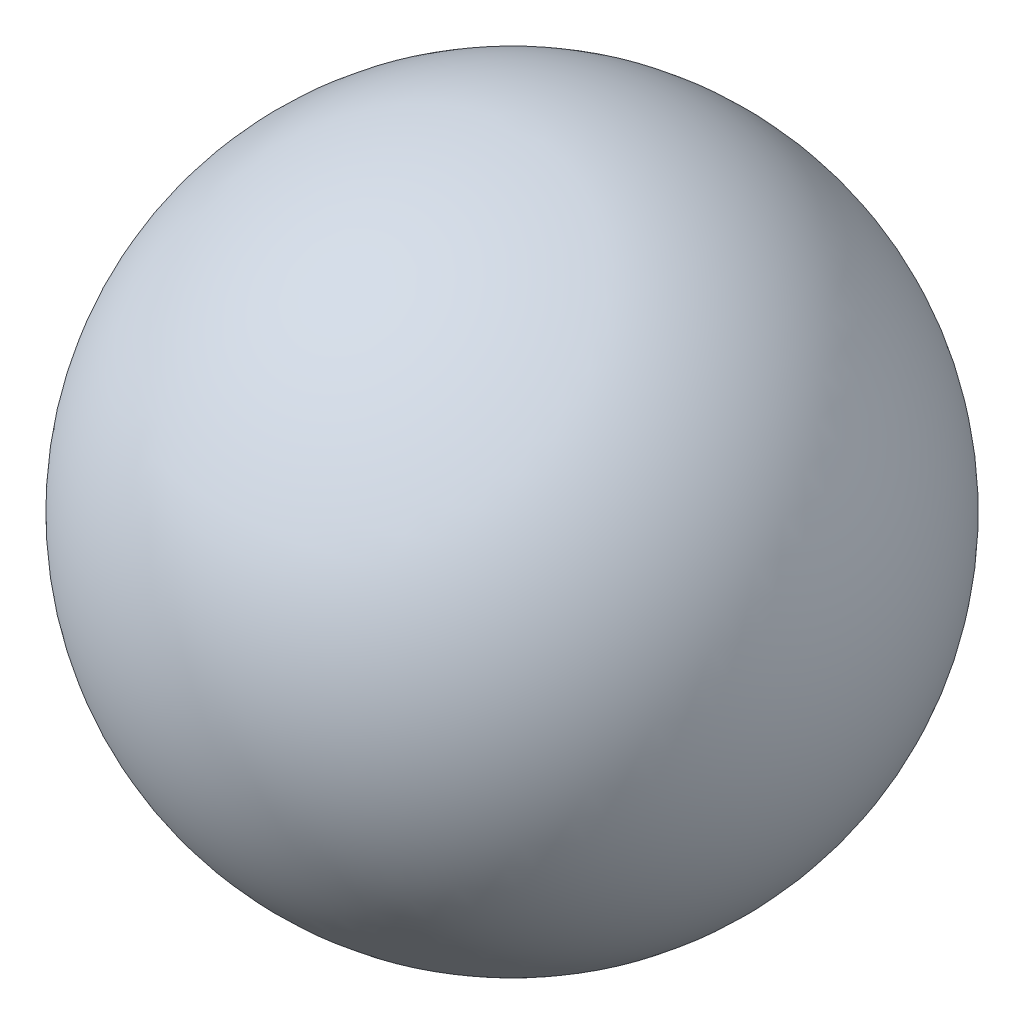
ISO-10303-21;
HEADER;
FILE_DESCRIPTION(('STEP AP214'),'2;1');
FILE_NAME('part.step','',(''),(''),'','','');
FILE_SCHEMA(('AUTOMOTIVE_DESIGN { 1 0 10303 214 1 1 1 1 }'));
ENDSEC;
DATA;
#1=APPLICATION_CONTEXT('core data for automotive mechanical design processes');
#2=APPLICATION_PROTOCOL_DEFINITION('international standard','automotive_design',2000,#1);
#3=PRODUCT_CONTEXT('',#1,'mechanical');
#4=PRODUCT('Part','Part','',(#3));
#5=PRODUCT_RELATED_PRODUCT_CATEGORY('part','',(#4));
#6=PRODUCT_DEFINITION_FORMATION('','',#4);
#7=PRODUCT_DEFINITION_CONTEXT('part definition',#1,'design');
#8=PRODUCT_DEFINITION('design','',#6,#7);
#9=PRODUCT_DEFINITION_SHAPE('','',#8);
#10=(LENGTH_UNIT() NAMED_UNIT(*) SI_UNIT(.MILLI.,.METRE.));
#11=(NAMED_UNIT(*) PLANE_ANGLE_UNIT() SI_UNIT($,.RADIAN.));
#12=(NAMED_UNIT(*) SI_UNIT($,.STERADIAN.) SOLID_ANGLE_UNIT());
#13=UNCERTAINTY_MEASURE_WITH_UNIT(LENGTH_MEASURE(1.E-05),#10,'distance_accuracy_value','');
#14=(GEOMETRIC_REPRESENTATION_CONTEXT(3) GLOBAL_UNCERTAINTY_ASSIGNED_CONTEXT((#13)) GLOBAL_UNIT_ASSIGNED_CONTEXT((#10,
#11,#12)) REPRESENTATION_CONTEXT('',''));
#15=CARTESIAN_POINT('',(0.,0.,0.));
#16=DIRECTION('',(0.,0.,1.));
#17=DIRECTION('',(1.,0.,0.));
#18=AXIS2_PLACEMENT_3D('',#15,#16,#17);
#19=CARTESIAN_POINT('',(0.,0.,0.));
#20=DIRECTION('',(0.,1.,0.));
#21=DIRECTION('',(1.,0.,0.));
#22=AXIS2_PLACEMENT_3D('',#19,#20,#21);
#23=SPHERICAL_SURFACE('',#22,11.25);
#24=CARTESIAN_POINT('',(0.,11.25,0.));
#25=VERTEX_POINT('',#24);
#26=VERTEX_LOOP('',#25);
#27=FACE_BOUND('',#26,.T.);
#28=ADVANCED_FACE('F28',(#27),#23,.T.);
#29=CLOSED_SHELL('',(#28));
#30=MANIFOLD_SOLID_BREP('B2',#29);
#31=ADVANCED_BREP_SHAPE_REPRESENTATION('',(#18,#30),#14);
#32=SHAPE_DEFINITION_REPRESENTATION(#9,#31);
ENDSEC;
END-ISO-10303-21;
